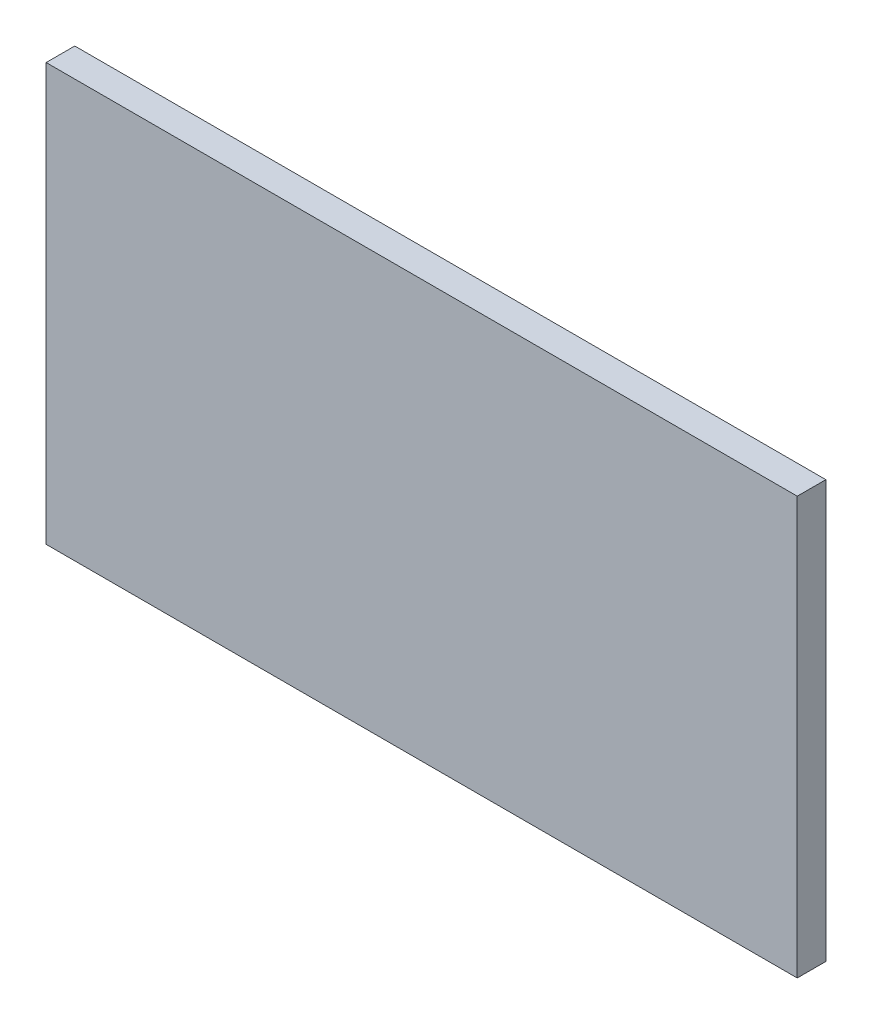
ISO-10303-21;
HEADER;
FILE_DESCRIPTION(('STEP AP214'),'2;1');
FILE_NAME('part.step','',(''),(''),'','','');
FILE_SCHEMA(('AUTOMOTIVE_DESIGN { 1 0 10303 214 1 1 1 1 }'));
ENDSEC;
DATA;
#1=APPLICATION_CONTEXT('core data for automotive mechanical design processes');
#2=APPLICATION_PROTOCOL_DEFINITION('international standard','automotive_design',2000,#1);
#3=PRODUCT_CONTEXT('',#1,'mechanical');
#4=PRODUCT('Part','Part','',(#3));
#5=PRODUCT_RELATED_PRODUCT_CATEGORY('part','',(#4));
#6=PRODUCT_DEFINITION_FORMATION('','',#4);
#7=PRODUCT_DEFINITION_CONTEXT('part definition',#1,'design');
#8=PRODUCT_DEFINITION('design','',#6,#7);
#9=PRODUCT_DEFINITION_SHAPE('','',#8);
#10=(LENGTH_UNIT() NAMED_UNIT(*) SI_UNIT(.MILLI.,.METRE.));
#11=(NAMED_UNIT(*) PLANE_ANGLE_UNIT() SI_UNIT($,.RADIAN.));
#12=(NAMED_UNIT(*) SI_UNIT($,.STERADIAN.) SOLID_ANGLE_UNIT());
#13=UNCERTAINTY_MEASURE_WITH_UNIT(LENGTH_MEASURE(1.E-05),#10,'distance_accuracy_value','');
#14=(GEOMETRIC_REPRESENTATION_CONTEXT(3) GLOBAL_UNCERTAINTY_ASSIGNED_CONTEXT((#13)) GLOBAL_UNIT_ASSIGNED_CONTEXT((#10,
#11,#12)) REPRESENTATION_CONTEXT('',''));
#15=CARTESIAN_POINT('',(0.,0.,0.));
#16=DIRECTION('',(0.,0.,1.));
#17=DIRECTION('',(1.,0.,0.));
#18=AXIS2_PLACEMENT_3D('',#15,#16,#17);
#19=CARTESIAN_POINT('',(12.50008,5.6,0.));
#20=DIRECTION('',(0.,0.,-1.));
#21=DIRECTION('',(-1.,0.,0.));
#22=AXIS2_PLACEMENT_3D('',#19,#20,#21);
#23=PLANE('',#22);
#24=DIRECTION('',(1.,0.,0.));
#25=VECTOR('',#24,1.);
#26=CARTESIAN_POINT('',(12.05008,5.85,0.));
#27=LINE('',#26,#25);
#28=CARTESIAN_POINT('',(12.05008,5.85,0.));
#29=VERTEX_POINT('',#28);
#30=CARTESIAN_POINT('',(12.95008,5.85,0.));
#31=VERTEX_POINT('',#30);
#32=EDGE_CURVE('E55',#29,#31,#27,.T.);
#33=ORIENTED_EDGE('',*,*,#32,.T.);
#34=DIRECTION('',(0.,1.,0.));
#35=VECTOR('',#34,1.);
#36=CARTESIAN_POINT('',(12.95008,5.85,0.));
#37=LINE('',#36,#35);
#38=CARTESIAN_POINT('',(12.95008,5.35,0.));
#39=VERTEX_POINT('',#38);
#40=EDGE_CURVE('E57',#31,#39,#37,.F.);
#41=ORIENTED_EDGE('',*,*,#40,.T.);
#42=DIRECTION('',(1.,0.,0.));
#43=VECTOR('',#42,1.);
#44=CARTESIAN_POINT('',(12.95008,5.35,0.));
#45=LINE('',#44,#43);
#46=CARTESIAN_POINT('',(12.05008,5.35,0.));
#47=VERTEX_POINT('',#46);
#48=EDGE_CURVE('E20',#39,#47,#45,.F.);
#49=ORIENTED_EDGE('',*,*,#48,.T.);
#50=DIRECTION('',(0.,1.,0.));
#51=VECTOR('',#50,1.);
#52=CARTESIAN_POINT('',(12.05008,5.35,0.));
#53=LINE('',#52,#51);
#54=EDGE_CURVE('E80',#47,#29,#53,.T.);
#55=ORIENTED_EDGE('',*,*,#54,.T.);
#56=EDGE_LOOP('',(#33,#41,#49,#55));
#57=FACE_BOUND('',#56,.T.);
#58=ADVANCED_FACE('F17',(#57),#23,.T.);
#59=CARTESIAN_POINT('',(12.95008,5.35,0.));
#60=DIRECTION('',(0.,1.,0.));
#61=DIRECTION('',(0.,0.,1.));
#62=AXIS2_PLACEMENT_3D('',#59,#60,#61);
#63=PLANE('',#62);
#64=DIRECTION('',(0.,0.,-1.));
#65=VECTOR('',#64,1.);
#66=CARTESIAN_POINT('',(12.05008,5.35,0.));
#67=LINE('',#66,#65);
#68=CARTESIAN_POINT('',(12.05008,5.35,0.03429));
#69=VERTEX_POINT('',#68);
#70=EDGE_CURVE('E68',#69,#47,#67,.T.);
#71=ORIENTED_EDGE('',*,*,#70,.T.);
#72=ORIENTED_EDGE('',*,*,#48,.F.);
#73=DIRECTION('',(0.,0.,1.));
#74=VECTOR('',#73,1.);
#75=CARTESIAN_POINT('',(12.95008,5.35,0.));
#76=LINE('',#75,#74);
#77=CARTESIAN_POINT('',(12.95008,5.35,0.03429));
#78=VERTEX_POINT('',#77);
#79=EDGE_CURVE('E63',#39,#78,#76,.T.);
#80=ORIENTED_EDGE('',*,*,#79,.T.);
#81=DIRECTION('',(1.,0.,0.));
#82=VECTOR('',#81,1.);
#83=CARTESIAN_POINT('',(12.50008,5.35,0.03429));
#84=LINE('',#83,#82);
#85=EDGE_CURVE('E83',#69,#78,#84,.T.);
#86=ORIENTED_EDGE('',*,*,#85,.F.);
#87=EDGE_LOOP('',(#71,#72,#80,#86));
#88=FACE_BOUND('',#87,.T.);
#89=ADVANCED_FACE('F65',(#88),#63,.F.);
#90=CARTESIAN_POINT('',(12.95008,5.85,0.));
#91=DIRECTION('',(-1.,0.,0.));
#92=DIRECTION('',(0.,0.,1.));
#93=AXIS2_PLACEMENT_3D('',#90,#91,#92);
#94=PLANE('',#93);
#95=ORIENTED_EDGE('',*,*,#79,.F.);
#96=ORIENTED_EDGE('',*,*,#40,.F.);
#97=DIRECTION('',(0.,0.,-1.));
#98=VECTOR('',#97,1.);
#99=CARTESIAN_POINT('',(12.95008,5.85,0.));
#100=LINE('',#99,#98);
#101=CARTESIAN_POINT('',(12.95008,5.85,0.03429));
#102=VERTEX_POINT('',#101);
#103=EDGE_CURVE('E75',#31,#102,#100,.F.);
#104=ORIENTED_EDGE('',*,*,#103,.T.);
#105=DIRECTION('',(0.,1.,0.));
#106=VECTOR('',#105,1.);
#107=CARTESIAN_POINT('',(12.95008,5.6,0.03429));
#108=LINE('',#107,#106);
#109=EDGE_CURVE('E72',#78,#102,#108,.T.);
#110=ORIENTED_EDGE('',*,*,#109,.F.);
#111=EDGE_LOOP('',(#95,#96,#104,#110));
#112=FACE_BOUND('',#111,.T.);
#113=ADVANCED_FACE('F70',(#112),#94,.F.);
#114=CARTESIAN_POINT('',(12.05008,5.85,0.));
#115=DIRECTION('',(0.,-1.,0.));
#116=DIRECTION('',(0.,0.,-1.));
#117=AXIS2_PLACEMENT_3D('',#114,#115,#116);
#118=PLANE('',#117);
#119=ORIENTED_EDGE('',*,*,#103,.F.);
#120=ORIENTED_EDGE('',*,*,#32,.F.);
#121=DIRECTION('',(0.,0.,-1.));
#122=VECTOR('',#121,1.);
#123=CARTESIAN_POINT('',(12.05008,5.85,0.));
#124=LINE('',#123,#122);
#125=CARTESIAN_POINT('',(12.05008,5.85,0.03429));
#126=VERTEX_POINT('',#125);
#127=EDGE_CURVE('E35',#29,#126,#124,.F.);
#128=ORIENTED_EDGE('',*,*,#127,.T.);
#129=DIRECTION('',(1.,0.,0.));
#130=VECTOR('',#129,1.);
#131=CARTESIAN_POINT('',(12.50008,5.85,0.03429));
#132=LINE('',#131,#130);
#133=EDGE_CURVE('E26',#102,#126,#132,.F.);
#134=ORIENTED_EDGE('',*,*,#133,.F.);
#135=EDGE_LOOP('',(#119,#120,#128,#134));
#136=FACE_BOUND('',#135,.T.);
#137=ADVANCED_FACE('F89',(#136),#118,.F.);
#138=CARTESIAN_POINT('',(12.05008,5.35,0.));
#139=DIRECTION('',(1.,0.,0.));
#140=DIRECTION('',(0.,0.,-1.));
#141=AXIS2_PLACEMENT_3D('',#138,#139,#140);
#142=PLANE('',#141);
#143=ORIENTED_EDGE('',*,*,#127,.F.);
#144=ORIENTED_EDGE('',*,*,#54,.F.);
#145=ORIENTED_EDGE('',*,*,#70,.F.);
#146=DIRECTION('',(0.,1.,0.));
#147=VECTOR('',#146,1.);
#148=CARTESIAN_POINT('',(12.05008,5.6,0.03429));
#149=LINE('',#148,#147);
#150=EDGE_CURVE('E11',#126,#69,#149,.F.);
#151=ORIENTED_EDGE('',*,*,#150,.F.);
#152=EDGE_LOOP('',(#143,#144,#145,#151));
#153=FACE_BOUND('',#152,.T.);
#154=ADVANCED_FACE('F91',(#153),#142,.F.);
#155=CARTESIAN_POINT('',(12.50008,5.6,0.03429));
#156=DIRECTION('',(0.,0.,1.));
#157=DIRECTION('',(1.,0.,0.));
#158=AXIS2_PLACEMENT_3D('',#155,#156,#157);
#159=PLANE('',#158);
#160=ORIENTED_EDGE('',*,*,#133,.T.);
#161=ORIENTED_EDGE('',*,*,#150,.T.);
#162=ORIENTED_EDGE('',*,*,#85,.T.);
#163=ORIENTED_EDGE('',*,*,#109,.T.);
#164=EDGE_LOOP('',(#160,#161,#162,#163));
#165=FACE_BOUND('',#164,.T.);
#166=ADVANCED_FACE('F88',(#165),#159,.T.);
#167=CLOSED_SHELL('',(#58,#89,#113,#137,#154,#166));
#168=MANIFOLD_SOLID_BREP('B1',#167);
#169=ADVANCED_BREP_SHAPE_REPRESENTATION('',(#18,#168),#14);
#170=SHAPE_DEFINITION_REPRESENTATION(#9,#169);
ENDSEC;
END-ISO-10303-21;
